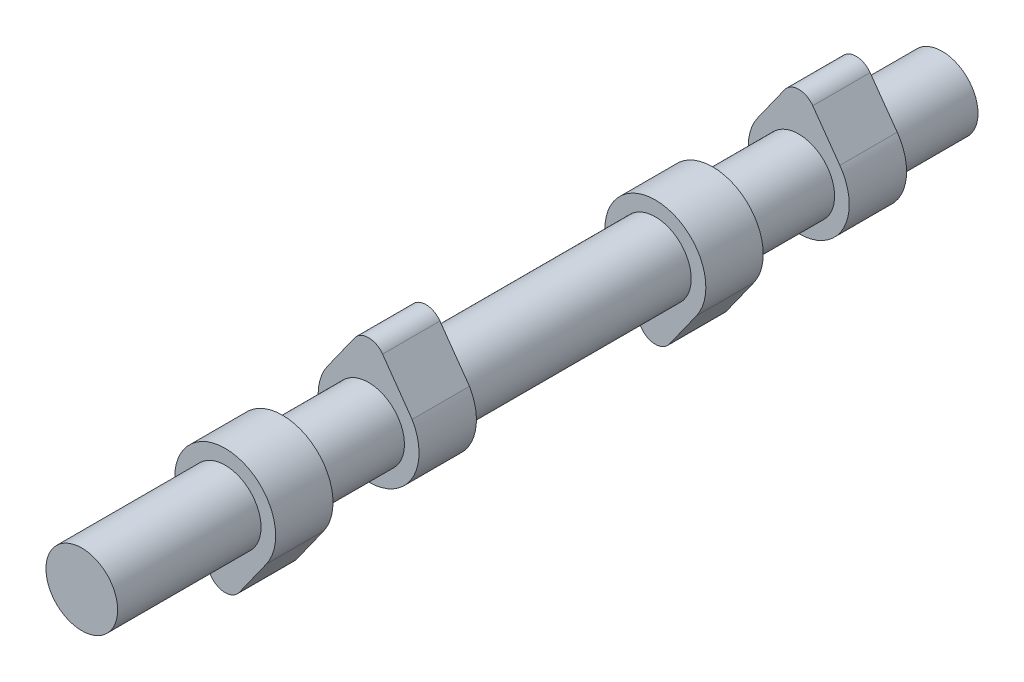
ISO-10303-21;
HEADER;
FILE_DESCRIPTION(('STEP AP214'),'2;1');
FILE_NAME('part.step','',(''),(''),'','','');
FILE_SCHEMA(('AUTOMOTIVE_DESIGN { 1 0 10303 214 1 1 1 1 }'));
ENDSEC;
DATA;
#1=APPLICATION_CONTEXT('core data for automotive mechanical design processes');
#2=APPLICATION_PROTOCOL_DEFINITION('international standard','automotive_design',2000,#1);
#3=PRODUCT_CONTEXT('',#1,'mechanical');
#4=PRODUCT('Part','Part','',(#3));
#5=PRODUCT_RELATED_PRODUCT_CATEGORY('part','',(#4));
#6=PRODUCT_DEFINITION_FORMATION('','',#4);
#7=PRODUCT_DEFINITION_CONTEXT('part definition',#1,'design');
#8=PRODUCT_DEFINITION('design','',#6,#7);
#9=PRODUCT_DEFINITION_SHAPE('','',#8);
#10=(LENGTH_UNIT() NAMED_UNIT(*) SI_UNIT(.MILLI.,.METRE.));
#11=(NAMED_UNIT(*) PLANE_ANGLE_UNIT() SI_UNIT($,.RADIAN.));
#12=(NAMED_UNIT(*) SI_UNIT($,.STERADIAN.) SOLID_ANGLE_UNIT());
#13=UNCERTAINTY_MEASURE_WITH_UNIT(LENGTH_MEASURE(1.E-05),#10,'distance_accuracy_value','');
#14=(GEOMETRIC_REPRESENTATION_CONTEXT(3) GLOBAL_UNCERTAINTY_ASSIGNED_CONTEXT((#13)) GLOBAL_UNIT_ASSIGNED_CONTEXT((#10,
#11,#12)) REPRESENTATION_CONTEXT('',''));
#15=CARTESIAN_POINT('',(0.,0.,0.));
#16=DIRECTION('',(0.,0.,1.));
#17=DIRECTION('',(1.,0.,0.));
#18=AXIS2_PLACEMENT_3D('',#15,#16,#17);
#19=CARTESIAN_POINT('',(0.,0.,125.));
#20=DIRECTION('',(0.,0.,-1.));
#21=DIRECTION('',(-1.,0.,0.));
#22=AXIS2_PLACEMENT_3D('',#19,#20,#21);
#23=CYLINDRICAL_SURFACE('',#22,6.25);
#24=CARTESIAN_POINT('',(0.,0.,40.));
#25=DIRECTION('',(0.,0.,-1.));
#26=DIRECTION('',(-1.,0.,0.));
#27=AXIS2_PLACEMENT_3D('',#24,#25,#26);
#28=CIRCLE('',#27,6.25);
#29=CARTESIAN_POINT('',(-6.25,0.,40.));
#30=VERTEX_POINT('',#29);
#31=EDGE_CURVE('E234',#30,#30,#28,.T.);
#32=ORIENTED_EDGE('',*,*,#31,.T.);
#33=EDGE_LOOP('',(#32));
#34=FACE_BOUND('',#33,.T.);
#35=CARTESIAN_POINT('',(0.,0.,25.));
#36=DIRECTION('',(0.,0.,-1.));
#37=DIRECTION('',(-1.,0.,0.));
#38=AXIS2_PLACEMENT_3D('',#35,#36,#37);
#39=CIRCLE('',#38,6.25);
#40=CARTESIAN_POINT('',(-6.25,0.,25.));
#41=VERTEX_POINT('',#40);
#42=EDGE_CURVE('E304',#41,#41,#39,.T.);
#43=ORIENTED_EDGE('',*,*,#42,.F.);
#44=EDGE_LOOP('',(#43));
#45=FACE_BOUND('',#44,.T.);
#46=ADVANCED_FACE('F37',(#34,#45),#23,.T.);
#47=CARTESIAN_POINT('',(0.,10.,25.));
#48=DIRECTION('',(0.,0.,-1.));
#49=DIRECTION('',(-1.,0.,0.));
#50=AXIS2_PLACEMENT_3D('',#47,#48,#49);
#51=CYLINDRICAL_SURFACE('',#50,3.);
#52=CARTESIAN_POINT('',(0.,10.,15.));
#53=DIRECTION('',(0.,0.,-1.));
#54=DIRECTION('',(-1.,0.,0.));
#55=AXIS2_PLACEMENT_3D('',#52,#53,#54);
#56=CIRCLE('',#55,3.);
#57=CARTESIAN_POINT('',(-2.44384942252996,11.74,15.));
#58=VERTEX_POINT('',#57);
#59=CARTESIAN_POINT('',(2.44384942252996,11.74,15.));
#60=VERTEX_POINT('',#59);
#61=EDGE_CURVE('E277',#58,#60,#56,.T.);
#62=ORIENTED_EDGE('',*,*,#61,.F.);
#63=DIRECTION('',(0.,0.,-1.));
#64=VECTOR('',#63,1.);
#65=CARTESIAN_POINT('',(-2.44384942252996,11.74,25.));
#66=LINE('',#65,#64);
#67=CARTESIAN_POINT('',(-2.44384942252996,11.74,25.));
#68=VERTEX_POINT('',#67);
#69=EDGE_CURVE('E55',#68,#58,#66,.T.);
#70=ORIENTED_EDGE('',*,*,#69,.F.);
#71=CARTESIAN_POINT('',(0.,10.,25.));
#72=DIRECTION('',(0.,0.,-1.));
#73=DIRECTION('',(-1.,0.,0.));
#74=AXIS2_PLACEMENT_3D('',#71,#72,#73);
#75=CIRCLE('',#74,3.);
#76=CARTESIAN_POINT('',(2.44384942252996,11.74,25.));
#77=VERTEX_POINT('',#76);
#78=EDGE_CURVE('E278',#68,#77,#75,.T.);
#79=ORIENTED_EDGE('',*,*,#78,.T.);
#80=DIRECTION('',(0.,0.,-1.));
#81=VECTOR('',#80,1.);
#82=CARTESIAN_POINT('',(2.44384942252996,11.74,25.));
#83=LINE('',#82,#81);
#84=EDGE_CURVE('E84',#77,#60,#83,.T.);
#85=ORIENTED_EDGE('',*,*,#84,.T.);
#86=EDGE_LOOP('',(#62,#70,#79,#85));
#87=FACE_BOUND('',#86,.T.);
#88=ADVANCED_FACE('F339',(#87),#51,.T.);
#89=CARTESIAN_POINT('',(-2.44384942252996,11.74,25.));
#90=DIRECTION('',(-0.814616474176652,0.58,0.));
#91=DIRECTION('',(-0.58,-0.814616474176652,0.));
#92=AXIS2_PLACEMENT_3D('',#89,#90,#91);
#93=PLANE('',#92);
#94=DIRECTION('',(0.58,0.814616474176652,0.));
#95=VECTOR('',#94,1.);
#96=CARTESIAN_POINT('',(-2.44384942252996,11.74,15.));
#97=LINE('',#96,#95);
#98=CARTESIAN_POINT('',(-7.16862497275454,5.104,15.));
#99=VERTEX_POINT('',#98);
#100=EDGE_CURVE('E281',#99,#58,#97,.T.);
#101=ORIENTED_EDGE('',*,*,#100,.F.);
#102=DIRECTION('',(0.,0.,-1.));
#103=VECTOR('',#102,1.);
#104=CARTESIAN_POINT('',(-7.16862497275454,5.104,25.));
#105=LINE('',#104,#103);
#106=CARTESIAN_POINT('',(-7.16862497275454,5.104,25.));
#107=VERTEX_POINT('',#106);
#108=EDGE_CURVE('E73',#107,#99,#105,.T.);
#109=ORIENTED_EDGE('',*,*,#108,.F.);
#110=DIRECTION('',(0.58,0.814616474176652,0.));
#111=VECTOR('',#110,1.);
#112=CARTESIAN_POINT('',(-2.44384942252996,11.74,25.));
#113=LINE('',#112,#111);
#114=EDGE_CURVE('E285',#107,#68,#113,.T.);
#115=ORIENTED_EDGE('',*,*,#114,.T.);
#116=ORIENTED_EDGE('',*,*,#69,.T.);
#117=EDGE_LOOP('',(#101,#109,#115,#116));
#118=FACE_BOUND('',#117,.T.);
#119=ADVANCED_FACE('F344',(#118),#93,.T.);
#120=CARTESIAN_POINT('',(0.,0.,25.));
#121=DIRECTION('',(0.,0.,-1.));
#122=DIRECTION('',(-1.,0.,0.));
#123=AXIS2_PLACEMENT_3D('',#120,#121,#122);
#124=CYLINDRICAL_SURFACE('',#123,8.8);
#125=CARTESIAN_POINT('',(0.,0.,15.));
#126=DIRECTION('',(0.,0.,-1.));
#127=DIRECTION('',(-1.,0.,0.));
#128=AXIS2_PLACEMENT_3D('',#125,#126,#127);
#129=CIRCLE('',#128,8.8);
#130=CARTESIAN_POINT('',(7.16862497275454,5.104,15.));
#131=VERTEX_POINT('',#130);
#132=EDGE_CURVE('E292',#131,#99,#129,.T.);
#133=ORIENTED_EDGE('',*,*,#132,.F.);
#134=DIRECTION('',(0.,0.,-1.));
#135=VECTOR('',#134,1.);
#136=CARTESIAN_POINT('',(7.16862497275454,5.104,25.));
#137=LINE('',#136,#135);
#138=CARTESIAN_POINT('',(7.16862497275454,5.104,25.));
#139=VERTEX_POINT('',#138);
#140=EDGE_CURVE('E299',#139,#131,#137,.T.);
#141=ORIENTED_EDGE('',*,*,#140,.F.);
#142=CARTESIAN_POINT('',(0.,0.,25.));
#143=DIRECTION('',(0.,0.,-1.));
#144=DIRECTION('',(-1.,0.,0.));
#145=AXIS2_PLACEMENT_3D('',#142,#143,#144);
#146=CIRCLE('',#145,8.8);
#147=EDGE_CURVE('E283',#139,#107,#146,.T.);
#148=ORIENTED_EDGE('',*,*,#147,.T.);
#149=ORIENTED_EDGE('',*,*,#108,.T.);
#150=EDGE_LOOP('',(#133,#141,#148,#149));
#151=FACE_BOUND('',#150,.T.);
#152=ADVANCED_FACE('F358',(#151),#124,.T.);
#153=CARTESIAN_POINT('',(2.44384942252996,11.74,25.));
#154=DIRECTION('',(0.814616474176652,0.58,0.));
#155=DIRECTION('',(-0.58,0.814616474176652,0.));
#156=AXIS2_PLACEMENT_3D('',#153,#154,#155);
#157=PLANE('',#156);
#158=DIRECTION('',(0.58,-0.814616474176652,0.));
#159=VECTOR('',#158,1.);
#160=CARTESIAN_POINT('',(2.44384942252996,11.74,15.));
#161=LINE('',#160,#159);
#162=EDGE_CURVE('E289',#60,#131,#161,.T.);
#163=ORIENTED_EDGE('',*,*,#162,.F.);
#164=ORIENTED_EDGE('',*,*,#84,.F.);
#165=DIRECTION('',(0.58,-0.814616474176652,0.));
#166=VECTOR('',#165,1.);
#167=CARTESIAN_POINT('',(2.44384942252996,11.74,25.));
#168=LINE('',#167,#166);
#169=EDGE_CURVE('E280',#77,#139,#168,.T.);
#170=ORIENTED_EDGE('',*,*,#169,.T.);
#171=ORIENTED_EDGE('',*,*,#140,.T.);
#172=EDGE_LOOP('',(#163,#164,#170,#171));
#173=FACE_BOUND('',#172,.T.);
#174=ADVANCED_FACE('F354',(#173),#157,.T.);
#175=CARTESIAN_POINT('',(0.,10.,25.));
#176=DIRECTION('',(0.,0.,-1.));
#177=DIRECTION('',(-1.,0.,0.));
#178=AXIS2_PLACEMENT_3D('',#175,#176,#177);
#179=PLANE('',#178);
#180=ORIENTED_EDGE('',*,*,#42,.T.);
#181=EDGE_LOOP('',(#180));
#182=FACE_BOUND('',#181,.T.);
#183=ORIENTED_EDGE('',*,*,#78,.F.);
#184=ORIENTED_EDGE('',*,*,#114,.F.);
#185=ORIENTED_EDGE('',*,*,#147,.F.);
#186=ORIENTED_EDGE('',*,*,#169,.F.);
#187=EDGE_LOOP('',(#183,#184,#185,#186));
#188=FACE_BOUND('',#187,.T.);
#189=ADVANCED_FACE('F350',(#182,#188),#179,.F.);
#190=CARTESIAN_POINT('',(0.,10.,15.));
#191=DIRECTION('',(0.,0.,-1.));
#192=DIRECTION('',(-1.,0.,0.));
#193=AXIS2_PLACEMENT_3D('',#190,#191,#192);
#194=PLANE('',#193);
#195=CARTESIAN_POINT('',(0.,0.,15.));
#196=DIRECTION('',(0.,0.,-1.));
#197=DIRECTION('',(-1.,0.,0.));
#198=AXIS2_PLACEMENT_3D('',#195,#196,#197);
#199=CIRCLE('',#198,6.25);
#200=CARTESIAN_POINT('',(-6.25,0.,15.));
#201=VERTEX_POINT('',#200);
#202=EDGE_CURVE('E269',#201,#201,#199,.T.);
#203=ORIENTED_EDGE('',*,*,#202,.F.);
#204=EDGE_LOOP('',(#203));
#205=FACE_BOUND('',#204,.T.);
#206=ORIENTED_EDGE('',*,*,#61,.T.);
#207=ORIENTED_EDGE('',*,*,#162,.T.);
#208=ORIENTED_EDGE('',*,*,#132,.T.);
#209=ORIENTED_EDGE('',*,*,#100,.T.);
#210=EDGE_LOOP('',(#206,#207,#208,#209));
#211=FACE_BOUND('',#210,.T.);
#212=ADVANCED_FACE('F353',(#205,#211),#194,.T.);
#213=CARTESIAN_POINT('',(0.,0.,0.));
#214=DIRECTION('',(0.,0.,1.));
#215=DIRECTION('',(1.,0.,0.));
#216=AXIS2_PLACEMENT_3D('',#213,#214,#215);
#217=PLANE('',#216);
#218=CARTESIAN_POINT('',(0.,0.,0.));
#219=DIRECTION('',(0.,0.,1.));
#220=DIRECTION('',(1.,0.,0.));
#221=AXIS2_PLACEMENT_3D('',#218,#219,#220);
#222=CIRCLE('',#221,6.25);
#223=CARTESIAN_POINT('',(6.25,0.,0.));
#224=VERTEX_POINT('',#223);
#225=EDGE_CURVE('E297',#224,#224,#222,.T.);
#226=ORIENTED_EDGE('',*,*,#225,.F.);
#227=EDGE_LOOP('',(#226));
#228=FACE_BOUND('',#227,.T.);
#229=ADVANCED_FACE('F336',(#228),#217,.F.);
#230=ORIENTED_EDGE('',*,*,#202,.T.);
#231=EDGE_LOOP('',(#230));
#232=FACE_BOUND('',#231,.T.);
#233=ORIENTED_EDGE('',*,*,#225,.T.);
#234=EDGE_LOOP('',(#233));
#235=FACE_BOUND('',#234,.T.);
#236=ADVANCED_FACE('F39',(#232,#235),#23,.T.);
#237=CARTESIAN_POINT('',(0.,-10.,50.));
#238=DIRECTION('',(0.,0.,-1.));
#239=DIRECTION('',(-1.,0.,0.));
#240=AXIS2_PLACEMENT_3D('',#237,#238,#239);
#241=CYLINDRICAL_SURFACE('',#240,3.);
#242=CARTESIAN_POINT('',(0.,-10.,40.));
#243=DIRECTION('',(0.,0.,-1.));
#244=DIRECTION('',(-1.,0.,0.));
#245=AXIS2_PLACEMENT_3D('',#242,#243,#244);
#246=CIRCLE('',#245,3.);
#247=CARTESIAN_POINT('',(2.4438494225301,-11.7399999999998,40.));
#248=VERTEX_POINT('',#247);
#249=CARTESIAN_POINT('',(-2.44384942252996,-11.74,40.));
#250=VERTEX_POINT('',#249);
#251=EDGE_CURVE('E242',#248,#250,#246,.T.);
#252=ORIENTED_EDGE('',*,*,#251,.F.);
#253=DIRECTION('',(0.,0.,-1.));
#254=VECTOR('',#253,1.);
#255=CARTESIAN_POINT('',(2.4438494225301,-11.7399999999998,50.));
#256=LINE('',#255,#254);
#257=CARTESIAN_POINT('',(2.4438494225301,-11.7399999999998,50.));
#258=VERTEX_POINT('',#257);
#259=EDGE_CURVE('E267',#258,#248,#256,.T.);
#260=ORIENTED_EDGE('',*,*,#259,.F.);
#261=CARTESIAN_POINT('',(0.,-10.,50.));
#262=DIRECTION('',(0.,0.,-1.));
#263=DIRECTION('',(-1.,0.,0.));
#264=AXIS2_PLACEMENT_3D('',#261,#262,#263);
#265=CIRCLE('',#264,3.);
#266=CARTESIAN_POINT('',(-2.44384942252996,-11.74,50.));
#267=VERTEX_POINT('',#266);
#268=EDGE_CURVE('E243',#258,#267,#265,.T.);
#269=ORIENTED_EDGE('',*,*,#268,.T.);
#270=DIRECTION('',(0.,0.,-1.));
#271=VECTOR('',#270,1.);
#272=CARTESIAN_POINT('',(-2.44384942252996,-11.74,50.));
#273=LINE('',#272,#271);
#274=EDGE_CURVE('E256',#267,#250,#273,.T.);
#275=ORIENTED_EDGE('',*,*,#274,.T.);
#276=EDGE_LOOP('',(#252,#260,#269,#275));
#277=FACE_BOUND('',#276,.T.);
#278=ADVANCED_FACE('F335',(#277),#241,.T.);
#279=CARTESIAN_POINT('',(2.4438494225301,-11.7399999999998,50.));
#280=DIRECTION('',(0.814616474176699,-0.579999999999935,0.));
#281=DIRECTION('',(0.579999999999935,0.814616474176699,0.));
#282=AXIS2_PLACEMENT_3D('',#279,#280,#281);
#283=PLANE('',#282);
#284=DIRECTION('',(-0.579999999999935,-0.814616474176699,0.));
#285=VECTOR('',#284,1.);
#286=CARTESIAN_POINT('',(2.4438494225301,-11.7399999999998,40.));
#287=LINE('',#286,#285);
#288=CARTESIAN_POINT('',(7.16862497275442,-5.10399999999905,40.));
#289=VERTEX_POINT('',#288);
#290=EDGE_CURVE('E247',#289,#248,#287,.T.);
#291=ORIENTED_EDGE('',*,*,#290,.F.);
#292=DIRECTION('',(0.,0.,-1.));
#293=VECTOR('',#292,1.);
#294=CARTESIAN_POINT('',(7.16862497275442,-5.10399999999905,50.));
#295=LINE('',#294,#293);
#296=CARTESIAN_POINT('',(7.16862497275442,-5.10399999999905,50.));
#297=VERTEX_POINT('',#296);
#298=EDGE_CURVE('E270',#297,#289,#295,.T.);
#299=ORIENTED_EDGE('',*,*,#298,.F.);
#300=DIRECTION('',(-0.579999999999935,-0.814616474176699,0.));
#301=VECTOR('',#300,1.);
#302=CARTESIAN_POINT('',(2.4438494225301,-11.7399999999998,50.));
#303=LINE('',#302,#301);
#304=EDGE_CURVE('E253',#297,#258,#303,.T.);
#305=ORIENTED_EDGE('',*,*,#304,.T.);
#306=ORIENTED_EDGE('',*,*,#259,.T.);
#307=EDGE_LOOP('',(#291,#299,#305,#306));
#308=FACE_BOUND('',#307,.T.);
#309=ADVANCED_FACE('F431',(#308),#283,.T.);
#310=CARTESIAN_POINT('',(0.,0.,50.));
#311=DIRECTION('',(0.,0.,-1.));
#312=DIRECTION('',(-1.,0.,0.));
#313=AXIS2_PLACEMENT_3D('',#310,#311,#312);
#314=CYLINDRICAL_SURFACE('',#313,8.79999999999935);
#315=CARTESIAN_POINT('',(0.,0.,40.));
#316=DIRECTION('',(0.,0.,-1.));
#317=DIRECTION('',(-1.,0.,0.));
#318=AXIS2_PLACEMENT_3D('',#315,#316,#317);
#319=CIRCLE('',#318,8.79999999999935);
#320=CARTESIAN_POINT('',(-7.16862497275441,-5.10399999999905,40.));
#321=VERTEX_POINT('',#320);
#322=EDGE_CURVE('E262',#321,#289,#319,.T.);
#323=ORIENTED_EDGE('',*,*,#322,.F.);
#324=DIRECTION('',(0.,0.,-1.));
#325=VECTOR('',#324,1.);
#326=CARTESIAN_POINT('',(-7.16862497275441,-5.10399999999905,50.));
#327=LINE('',#326,#325);
#328=CARTESIAN_POINT('',(-7.16862497275441,-5.10399999999905,50.));
#329=VERTEX_POINT('',#328);
#330=EDGE_CURVE('E272',#329,#321,#327,.T.);
#331=ORIENTED_EDGE('',*,*,#330,.F.);
#332=CARTESIAN_POINT('',(0.,0.,50.));
#333=DIRECTION('',(0.,0.,-1.));
#334=DIRECTION('',(-1.,0.,0.));
#335=AXIS2_PLACEMENT_3D('',#332,#333,#334);
#336=CIRCLE('',#335,8.79999999999935);
#337=EDGE_CURVE('E250',#329,#297,#336,.T.);
#338=ORIENTED_EDGE('',*,*,#337,.T.);
#339=ORIENTED_EDGE('',*,*,#298,.T.);
#340=EDGE_LOOP('',(#323,#331,#338,#339));
#341=FACE_BOUND('',#340,.T.);
#342=ADVANCED_FACE('F434',(#341),#314,.T.);
#343=CARTESIAN_POINT('',(-2.44384942252996,-11.74,50.));
#344=DIRECTION('',(-0.814616474176699,-0.579999999999934,0.));
#345=DIRECTION('',(0.579999999999934,-0.814616474176699,0.));
#346=AXIS2_PLACEMENT_3D('',#343,#344,#345);
#347=PLANE('',#346);
#348=DIRECTION('',(-0.579999999999934,0.814616474176699,0.));
#349=VECTOR('',#348,1.);
#350=CARTESIAN_POINT('',(-2.44384942252996,-11.74,40.));
#351=LINE('',#350,#349);
#352=EDGE_CURVE('E259',#250,#321,#351,.T.);
#353=ORIENTED_EDGE('',*,*,#352,.F.);
#354=ORIENTED_EDGE('',*,*,#274,.F.);
#355=DIRECTION('',(-0.579999999999934,0.814616474176699,0.));
#356=VECTOR('',#355,1.);
#357=CARTESIAN_POINT('',(-2.44384942252996,-11.74,50.));
#358=LINE('',#357,#356);
#359=EDGE_CURVE('E246',#267,#329,#358,.T.);
#360=ORIENTED_EDGE('',*,*,#359,.T.);
#361=ORIENTED_EDGE('',*,*,#330,.T.);
#362=EDGE_LOOP('',(#353,#354,#360,#361));
#363=FACE_BOUND('',#362,.T.);
#364=ADVANCED_FACE('F427',(#363),#347,.T.);
#365=CARTESIAN_POINT('',(0.,-10.,50.));
#366=DIRECTION('',(0.,0.,-1.));
#367=DIRECTION('',(-1.,0.,0.));
#368=AXIS2_PLACEMENT_3D('',#365,#366,#367);
#369=PLANE('',#368);
#370=CARTESIAN_POINT('',(0.,0.,50.));
#371=DIRECTION('',(0.,0.,-1.));
#372=DIRECTION('',(-1.,0.,0.));
#373=AXIS2_PLACEMENT_3D('',#370,#371,#372);
#374=CIRCLE('',#373,6.25);
#375=CARTESIAN_POINT('',(-6.25,0.,50.));
#376=VERTEX_POINT('',#375);
#377=EDGE_CURVE('E306',#376,#376,#374,.T.);
#378=ORIENTED_EDGE('',*,*,#377,.T.);
#379=EDGE_LOOP('',(#378));
#380=FACE_BOUND('',#379,.T.);
#381=ORIENTED_EDGE('',*,*,#268,.F.);
#382=ORIENTED_EDGE('',*,*,#304,.F.);
#383=ORIENTED_EDGE('',*,*,#337,.F.);
#384=ORIENTED_EDGE('',*,*,#359,.F.);
#385=EDGE_LOOP('',(#381,#382,#383,#384));
#386=FACE_BOUND('',#385,.T.);
#387=ADVANCED_FACE('F424',(#380,#386),#369,.F.);
#388=CARTESIAN_POINT('',(0.,-10.,40.));
#389=DIRECTION('',(0.,0.,-1.));
#390=DIRECTION('',(-1.,0.,0.));
#391=AXIS2_PLACEMENT_3D('',#388,#389,#390);
#392=PLANE('',#391);
#393=ORIENTED_EDGE('',*,*,#31,.F.);
#394=EDGE_LOOP('',(#393));
#395=FACE_BOUND('',#394,.T.);
#396=ORIENTED_EDGE('',*,*,#251,.T.);
#397=ORIENTED_EDGE('',*,*,#352,.T.);
#398=ORIENTED_EDGE('',*,*,#322,.T.);
#399=ORIENTED_EDGE('',*,*,#290,.T.);
#400=EDGE_LOOP('',(#396,#397,#398,#399));
#401=FACE_BOUND('',#400,.T.);
#402=ADVANCED_FACE('F332',(#395,#401),#392,.T.);
#403=CARTESIAN_POINT('',(0.,0.,90.));
#404=DIRECTION('',(0.,0.,-1.));
#405=DIRECTION('',(-1.,0.,0.));
#406=AXIS2_PLACEMENT_3D('',#403,#404,#405);
#407=CIRCLE('',#406,6.25);
#408=CARTESIAN_POINT('',(-6.25,0.,90.));
#409=VERTEX_POINT('',#408);
#410=EDGE_CURVE('E202',#409,#409,#407,.T.);
#411=ORIENTED_EDGE('',*,*,#410,.T.);
#412=EDGE_LOOP('',(#411));
#413=FACE_BOUND('',#412,.T.);
#414=ORIENTED_EDGE('',*,*,#377,.F.);
#415=EDGE_LOOP('',(#414));
#416=FACE_BOUND('',#415,.T.);
#417=ADVANCED_FACE('F320',(#413,#416),#23,.T.);
#418=CARTESIAN_POINT('',(-7.16862497275454,5.104,100.));
#419=DIRECTION('',(0.814616474176652,-0.58,0.));
#420=DIRECTION('',(0.58,0.814616474176652,0.));
#421=AXIS2_PLACEMENT_3D('',#418,#419,#420);
#422=PLANE('',#421);
#423=DIRECTION('',(-0.58,-0.814616474176652,0.));
#424=VECTOR('',#423,1.);
#425=CARTESIAN_POINT('',(-7.16862497275454,5.104,90.));
#426=LINE('',#425,#424);
#427=CARTESIAN_POINT('',(-2.44384942252996,11.74,90.));
#428=VERTEX_POINT('',#427);
#429=CARTESIAN_POINT('',(-7.16862497275454,5.104,90.));
#430=VERTEX_POINT('',#429);
#431=EDGE_CURVE('E221',#428,#430,#426,.T.);
#432=ORIENTED_EDGE('',*,*,#431,.T.);
#433=DIRECTION('',(0.,0.,-1.));
#434=VECTOR('',#433,1.);
#435=CARTESIAN_POINT('',(-7.16862497275454,5.104,100.));
#436=LINE('',#435,#434);
#437=CARTESIAN_POINT('',(-7.16862497275454,5.104,100.));
#438=VERTEX_POINT('',#437);
#439=EDGE_CURVE('E232',#438,#430,#436,.T.);
#440=ORIENTED_EDGE('',*,*,#439,.F.);
#441=DIRECTION('',(-0.58,-0.814616474176652,0.));
#442=VECTOR('',#441,1.);
#443=CARTESIAN_POINT('',(-7.16862497275454,5.104,100.));
#444=LINE('',#443,#442);
#445=CARTESIAN_POINT('',(-2.44384942252996,11.74,100.));
#446=VERTEX_POINT('',#445);
#447=EDGE_CURVE('E206',#446,#438,#444,.T.);
#448=ORIENTED_EDGE('',*,*,#447,.F.);
#449=DIRECTION('',(0.,0.,-1.));
#450=VECTOR('',#449,1.);
#451=CARTESIAN_POINT('',(-2.44384942252996,11.74,100.));
#452=LINE('',#451,#450);
#453=EDGE_CURVE('E218',#446,#428,#452,.T.);
#454=ORIENTED_EDGE('',*,*,#453,.T.);
#455=EDGE_LOOP('',(#432,#440,#448,#454));
#456=FACE_BOUND('',#455,.T.);
#457=ADVANCED_FACE('F331',(#456),#422,.F.);
#458=CARTESIAN_POINT('',(0.,0.,100.));
#459=DIRECTION('',(0.,0.,-1.));
#460=DIRECTION('',(-1.,0.,0.));
#461=AXIS2_PLACEMENT_3D('',#458,#459,#460);
#462=CYLINDRICAL_SURFACE('',#461,8.8);
#463=CARTESIAN_POINT('',(0.,0.,90.));
#464=DIRECTION('',(0.,0.,-1.));
#465=DIRECTION('',(-1.,0.,0.));
#466=AXIS2_PLACEMENT_3D('',#463,#464,#465);
#467=CIRCLE('',#466,8.8);
#468=CARTESIAN_POINT('',(7.58748192688418,4.45759105450533,90.));
#469=VERTEX_POINT('',#468);
#470=EDGE_CURVE('E209',#469,#430,#467,.T.);
#471=ORIENTED_EDGE('',*,*,#470,.F.);
#472=DIRECTION('',(0.,0.,-1.));
#473=VECTOR('',#472,1.);
#474=CARTESIAN_POINT('',(7.58748192688418,4.45759105450533,100.));
#475=LINE('',#474,#473);
#476=CARTESIAN_POINT('',(7.58748192688418,4.45759105450533,100.));
#477=VERTEX_POINT('',#476);
#478=EDGE_CURVE('E235',#477,#469,#475,.T.);
#479=ORIENTED_EDGE('',*,*,#478,.F.);
#480=CARTESIAN_POINT('',(0.,0.,100.));
#481=DIRECTION('',(0.,0.,-1.));
#482=DIRECTION('',(-1.,0.,0.));
#483=AXIS2_PLACEMENT_3D('',#480,#481,#482);
#484=CIRCLE('',#483,8.8);
#485=EDGE_CURVE('E215',#477,#438,#484,.T.);
#486=ORIENTED_EDGE('',*,*,#485,.T.);
#487=ORIENTED_EDGE('',*,*,#439,.T.);
#488=EDGE_LOOP('',(#471,#479,#486,#487));
#489=FACE_BOUND('',#488,.T.);
#490=ADVANCED_FACE('F410',(#489),#462,.T.);
#491=CARTESIAN_POINT('',(7.1626626770346,5.05905461215725,100.));
#492=DIRECTION('',(0.816803566389261,0.576915881159277,0.));
#493=DIRECTION('',(-0.576915881159277,0.816803566389261,0.));
#494=AXIS2_PLACEMENT_3D('',#491,#492,#493);
#495=PLANE('',#494);
#496=DIRECTION('',(0.576915881159277,-0.816803566389261,0.));
#497=VECTOR('',#496,1.);
#498=CARTESIAN_POINT('',(7.1626626770346,5.05905461215725,90.));
#499=LINE('',#498,#497);
#500=CARTESIAN_POINT('',(2.44384942252996,11.74,90.));
#501=VERTEX_POINT('',#500);
#502=EDGE_CURVE('E227',#501,#469,#499,.T.);
#503=ORIENTED_EDGE('',*,*,#502,.F.);
#504=DIRECTION('',(0.,0.,-1.));
#505=VECTOR('',#504,1.);
#506=CARTESIAN_POINT('',(2.44384942252996,11.74,100.));
#507=LINE('',#506,#505);
#508=CARTESIAN_POINT('',(2.44384942252996,11.74,100.));
#509=VERTEX_POINT('',#508);
#510=EDGE_CURVE('E237',#509,#501,#507,.T.);
#511=ORIENTED_EDGE('',*,*,#510,.F.);
#512=DIRECTION('',(0.576915881159277,-0.816803566389261,0.));
#513=VECTOR('',#512,1.);
#514=CARTESIAN_POINT('',(7.1626626770346,5.05905461215725,100.));
#515=LINE('',#514,#513);
#516=EDGE_CURVE('E212',#509,#477,#515,.T.);
#517=ORIENTED_EDGE('',*,*,#516,.T.);
#518=ORIENTED_EDGE('',*,*,#478,.T.);
#519=EDGE_LOOP('',(#503,#511,#517,#518));
#520=FACE_BOUND('',#519,.T.);
#521=ADVANCED_FACE('F413',(#520),#495,.T.);
#522=CARTESIAN_POINT('',(0.,10.,100.));
#523=DIRECTION('',(0.,0.,-1.));
#524=DIRECTION('',(-1.,0.,0.));
#525=AXIS2_PLACEMENT_3D('',#522,#523,#524);
#526=CYLINDRICAL_SURFACE('',#525,3.);
#527=CARTESIAN_POINT('',(0.,10.,90.));
#528=DIRECTION('',(0.,0.,-1.));
#529=DIRECTION('',(-1.,0.,0.));
#530=AXIS2_PLACEMENT_3D('',#527,#528,#529);
#531=CIRCLE('',#530,3.);
#532=EDGE_CURVE('E224',#428,#501,#531,.T.);
#533=ORIENTED_EDGE('',*,*,#532,.F.);
#534=ORIENTED_EDGE('',*,*,#453,.F.);
#535=CARTESIAN_POINT('',(0.,10.,100.));
#536=DIRECTION('',(0.,0.,-1.));
#537=DIRECTION('',(-1.,0.,0.));
#538=AXIS2_PLACEMENT_3D('',#535,#536,#537);
#539=CIRCLE('',#538,3.);
#540=EDGE_CURVE('E208',#446,#509,#539,.T.);
#541=ORIENTED_EDGE('',*,*,#540,.T.);
#542=ORIENTED_EDGE('',*,*,#510,.T.);
#543=EDGE_LOOP('',(#533,#534,#541,#542));
#544=FACE_BOUND('',#543,.T.);
#545=ADVANCED_FACE('F408',(#544),#526,.T.);
#546=CARTESIAN_POINT('',(0.,0.,100.));
#547=DIRECTION('',(0.,0.,-1.));
#548=DIRECTION('',(-1.,0.,0.));
#549=AXIS2_PLACEMENT_3D('',#546,#547,#548);
#550=PLANE('',#549);
#551=CARTESIAN_POINT('',(0.,0.,100.));
#552=DIRECTION('',(0.,0.,-1.));
#553=DIRECTION('',(-1.,0.,0.));
#554=AXIS2_PLACEMENT_3D('',#551,#552,#553);
#555=CIRCLE('',#554,6.25);
#556=CARTESIAN_POINT('',(-6.25,0.,100.));
#557=VERTEX_POINT('',#556);
#558=EDGE_CURVE('E41',#557,#557,#555,.T.);
#559=ORIENTED_EDGE('',*,*,#558,.T.);
#560=EDGE_LOOP('',(#559));
#561=FACE_BOUND('',#560,.T.);
#562=ORIENTED_EDGE('',*,*,#447,.T.);
#563=ORIENTED_EDGE('',*,*,#485,.F.);
#564=ORIENTED_EDGE('',*,*,#516,.F.);
#565=ORIENTED_EDGE('',*,*,#540,.F.);
#566=EDGE_LOOP('',(#562,#563,#564,#565));
#567=FACE_BOUND('',#566,.T.);
#568=ADVANCED_FACE('F313',(#561,#567),#550,.F.);
#569=CARTESIAN_POINT('',(0.,0.,90.));
#570=DIRECTION('',(0.,0.,-1.));
#571=DIRECTION('',(-1.,0.,0.));
#572=AXIS2_PLACEMENT_3D('',#569,#570,#571);
#573=PLANE('',#572);
#574=ORIENTED_EDGE('',*,*,#410,.F.);
#575=EDGE_LOOP('',(#574));
#576=FACE_BOUND('',#575,.T.);
#577=ORIENTED_EDGE('',*,*,#431,.F.);
#578=ORIENTED_EDGE('',*,*,#532,.T.);
#579=ORIENTED_EDGE('',*,*,#502,.T.);
#580=ORIENTED_EDGE('',*,*,#470,.T.);
#581=EDGE_LOOP('',(#577,#578,#579,#580));
#582=FACE_BOUND('',#581,.T.);
#583=ADVANCED_FACE('F318',(#576,#582),#573,.T.);
#584=CARTESIAN_POINT('',(0.,0.,115.));
#585=DIRECTION('',(0.,0.,-1.));
#586=DIRECTION('',(-1.,0.,0.));
#587=AXIS2_PLACEMENT_3D('',#584,#585,#586);
#588=CIRCLE('',#587,6.25);
#589=CARTESIAN_POINT('',(-6.25,0.,115.));
#590=VERTEX_POINT('',#589);
#591=EDGE_CURVE('E192',#590,#590,#588,.T.);
#592=ORIENTED_EDGE('',*,*,#591,.T.);
#593=EDGE_LOOP('',(#592));
#594=FACE_BOUND('',#593,.T.);
#595=ORIENTED_EDGE('',*,*,#558,.F.);
#596=EDGE_LOOP('',(#595));
#597=FACE_BOUND('',#596,.T.);
#598=ADVANCED_FACE('F316',(#594,#597),#23,.T.);
#599=CARTESIAN_POINT('',(0.,-10.,125.));
#600=DIRECTION('',(0.,0.,-1.));
#601=DIRECTION('',(-1.,0.,0.));
#602=AXIS2_PLACEMENT_3D('',#599,#600,#601);
#603=CYLINDRICAL_SURFACE('',#602,3.);
#604=CARTESIAN_POINT('',(0.,-10.,115.));
#605=DIRECTION('',(0.,0.,-1.));
#606=DIRECTION('',(-1.,0.,0.));
#607=AXIS2_PLACEMENT_3D('',#604,#605,#606);
#608=CIRCLE('',#607,3.);
#609=CARTESIAN_POINT('',(2.4438494225301,-11.7399999999998,115.));
#610=VERTEX_POINT('',#609);
#611=CARTESIAN_POINT('',(-2.44384942252996,-11.74,115.));
#612=VERTEX_POINT('',#611);
#613=EDGE_CURVE('E196',#610,#612,#608,.T.);
#614=ORIENTED_EDGE('',*,*,#613,.F.);
#615=DIRECTION('',(0.,0.,-1.));
#616=VECTOR('',#615,1.);
#617=CARTESIAN_POINT('',(2.4438494225301,-11.7399999999998,125.));
#618=LINE('',#617,#616);
#619=CARTESIAN_POINT('',(2.4438494225301,-11.7399999999998,125.));
#620=VERTEX_POINT('',#619);
#621=EDGE_CURVE('E185',#620,#610,#618,.T.);
#622=ORIENTED_EDGE('',*,*,#621,.F.);
#623=CARTESIAN_POINT('',(0.,-10.,125.));
#624=DIRECTION('',(0.,0.,-1.));
#625=DIRECTION('',(-1.,0.,0.));
#626=AXIS2_PLACEMENT_3D('',#623,#624,#625);
#627=CIRCLE('',#626,3.);
#628=CARTESIAN_POINT('',(-2.44384942252996,-11.74,125.));
#629=VERTEX_POINT('',#628);
#630=EDGE_CURVE('E179',#620,#629,#627,.T.);
#631=ORIENTED_EDGE('',*,*,#630,.T.);
#632=DIRECTION('',(0.,0.,-1.));
#633=VECTOR('',#632,1.);
#634=CARTESIAN_POINT('',(-2.44384942252996,-11.74,125.));
#635=LINE('',#634,#633);
#636=EDGE_CURVE('E161',#629,#612,#635,.T.);
#637=ORIENTED_EDGE('',*,*,#636,.T.);
#638=EDGE_LOOP('',(#614,#622,#631,#637));
#639=FACE_BOUND('',#638,.T.);
#640=ADVANCED_FACE('F184',(#639),#603,.T.);
#641=CARTESIAN_POINT('',(7.16862497275442,-5.10399999999905,125.));
#642=DIRECTION('',(0.814616474176699,-0.579999999999935,0.));
#643=DIRECTION('',(0.579999999999935,0.814616474176699,0.));
#644=AXIS2_PLACEMENT_3D('',#641,#642,#643);
#645=PLANE('',#644);
#646=DIRECTION('',(-0.579999999999935,-0.814616474176699,0.));
#647=VECTOR('',#646,1.);
#648=CARTESIAN_POINT('',(7.16862497275442,-5.10399999999905,115.));
#649=LINE('',#648,#647);
#650=CARTESIAN_POINT('',(7.16862497275442,-5.10399999999905,115.));
#651=VERTEX_POINT('',#650);
#652=EDGE_CURVE('E186',#651,#610,#649,.T.);
#653=ORIENTED_EDGE('',*,*,#652,.F.);
#654=DIRECTION('',(0.,0.,-1.));
#655=VECTOR('',#654,1.);
#656=CARTESIAN_POINT('',(7.16862497275442,-5.10399999999905,125.));
#657=LINE('',#656,#655);
#658=CARTESIAN_POINT('',(7.16862497275442,-5.10399999999905,125.));
#659=VERTEX_POINT('',#658);
#660=EDGE_CURVE('E203',#659,#651,#657,.T.);
#661=ORIENTED_EDGE('',*,*,#660,.F.);
#662=DIRECTION('',(-0.579999999999935,-0.814616474176699,0.));
#663=VECTOR('',#662,1.);
#664=CARTESIAN_POINT('',(7.16862497275442,-5.10399999999905,125.));
#665=LINE('',#664,#663);
#666=EDGE_CURVE('E172',#659,#620,#665,.T.);
#667=ORIENTED_EDGE('',*,*,#666,.T.);
#668=ORIENTED_EDGE('',*,*,#621,.T.);
#669=EDGE_LOOP('',(#653,#661,#667,#668));
#670=FACE_BOUND('',#669,.T.);
#671=ADVANCED_FACE('F325',(#670),#645,.T.);
#672=CARTESIAN_POINT('',(0.,0.,125.));
#673=DIRECTION('',(0.,0.,-1.));
#674=DIRECTION('',(-1.,0.,0.));
#675=AXIS2_PLACEMENT_3D('',#672,#673,#674);
#676=CYLINDRICAL_SURFACE('',#675,8.79999999999935);
#677=CARTESIAN_POINT('',(0.,0.,115.));
#678=DIRECTION('',(0.,0.,-1.));
#679=DIRECTION('',(-1.,0.,0.));
#680=AXIS2_PLACEMENT_3D('',#677,#678,#679);
#681=CIRCLE('',#680,8.79999999999935);
#682=CARTESIAN_POINT('',(-7.16862497275441,-5.10399999999905,115.));
#683=VERTEX_POINT('',#682);
#684=EDGE_CURVE('E189',#683,#651,#681,.T.);
#685=ORIENTED_EDGE('',*,*,#684,.F.);
#686=DIRECTION('',(0.,0.,-1.));
#687=VECTOR('',#686,1.);
#688=CARTESIAN_POINT('',(-7.16862497275441,-5.10399999999905,125.));
#689=LINE('',#688,#687);
#690=CARTESIAN_POINT('',(-7.16862497275441,-5.10399999999905,125.));
#691=VERTEX_POINT('',#690);
#692=EDGE_CURVE('E171',#691,#683,#689,.T.);
#693=ORIENTED_EDGE('',*,*,#692,.F.);
#694=CARTESIAN_POINT('',(0.,0.,125.));
#695=DIRECTION('',(0.,0.,-1.));
#696=DIRECTION('',(-1.,0.,0.));
#697=AXIS2_PLACEMENT_3D('',#694,#695,#696);
#698=CIRCLE('',#697,8.79999999999935);
#699=EDGE_CURVE('E182',#691,#659,#698,.T.);
#700=ORIENTED_EDGE('',*,*,#699,.T.);
#701=ORIENTED_EDGE('',*,*,#660,.T.);
#702=EDGE_LOOP('',(#685,#693,#700,#701));
#703=FACE_BOUND('',#702,.T.);
#704=ADVANCED_FACE('F395',(#703),#676,.T.);
#705=CARTESIAN_POINT('',(-2.44384942252996,-11.74,125.));
#706=DIRECTION('',(-0.814616474176699,-0.579999999999934,0.));
#707=DIRECTION('',(0.579999999999934,-0.814616474176699,0.));
#708=AXIS2_PLACEMENT_3D('',#705,#706,#707);
#709=PLANE('',#708);
#710=DIRECTION('',(-0.579999999999935,0.814616474176699,0.));
#711=VECTOR('',#710,1.);
#712=CARTESIAN_POINT('',(-2.44384942252996,-11.74,115.));
#713=LINE('',#712,#711);
#714=EDGE_CURVE('E166',#612,#683,#713,.T.);
#715=ORIENTED_EDGE('',*,*,#714,.F.);
#716=ORIENTED_EDGE('',*,*,#636,.F.);
#717=DIRECTION('',(-0.579999999999935,0.814616474176699,0.));
#718=VECTOR('',#717,1.);
#719=CARTESIAN_POINT('',(-2.44384942252996,-11.74,125.));
#720=LINE('',#719,#718);
#721=EDGE_CURVE('E164',#629,#691,#720,.T.);
#722=ORIENTED_EDGE('',*,*,#721,.T.);
#723=ORIENTED_EDGE('',*,*,#692,.T.);
#724=EDGE_LOOP('',(#715,#716,#722,#723));
#725=FACE_BOUND('',#724,.T.);
#726=ADVANCED_FACE('F163',(#725),#709,.T.);
#727=CARTESIAN_POINT('',(0.,-10.,115.));
#728=DIRECTION('',(0.,0.,-1.));
#729=DIRECTION('',(-1.,0.,0.));
#730=AXIS2_PLACEMENT_3D('',#727,#728,#729);
#731=PLANE('',#730);
#732=ORIENTED_EDGE('',*,*,#591,.F.);
#733=EDGE_LOOP('',(#732));
#734=FACE_BOUND('',#733,.T.);
#735=ORIENTED_EDGE('',*,*,#613,.T.);
#736=ORIENTED_EDGE('',*,*,#714,.T.);
#737=ORIENTED_EDGE('',*,*,#684,.T.);
#738=ORIENTED_EDGE('',*,*,#652,.T.);
#739=EDGE_LOOP('',(#735,#736,#737,#738));
#740=FACE_BOUND('',#739,.T.);
#741=ADVANCED_FACE('F378',(#734,#740),#731,.T.);
#742=CARTESIAN_POINT('',(0.,0.,125.));
#743=DIRECTION('',(0.,0.,1.));
#744=DIRECTION('',(1.,0.,0.));
#745=AXIS2_PLACEMENT_3D('',#742,#743,#744);
#746=PLANE('',#745);
#747=CARTESIAN_POINT('',(0.,0.,125.));
#748=DIRECTION('',(0.,0.,1.));
#749=DIRECTION('',(1.,0.,0.));
#750=AXIS2_PLACEMENT_3D('',#747,#748,#749);
#751=CIRCLE('',#750,6.25);
#752=CARTESIAN_POINT('',(6.25,0.,125.));
#753=VERTEX_POINT('',#752);
#754=EDGE_CURVE('E11',#753,#753,#751,.T.);
#755=ORIENTED_EDGE('',*,*,#754,.F.);
#756=EDGE_LOOP('',(#755));
#757=FACE_BOUND('',#756,.T.);
#758=ORIENTED_EDGE('',*,*,#630,.F.);
#759=ORIENTED_EDGE('',*,*,#666,.F.);
#760=ORIENTED_EDGE('',*,*,#699,.F.);
#761=ORIENTED_EDGE('',*,*,#721,.F.);
#762=EDGE_LOOP('',(#758,#759,#760,#761));
#763=FACE_BOUND('',#762,.T.);
#764=ADVANCED_FACE('F177',(#757,#763),#746,.T.);
#765=CARTESIAN_POINT('',(0.,0.,150.));
#766=DIRECTION('',(0.,0.,-1.));
#767=DIRECTION('',(-1.,0.,0.));
#768=AXIS2_PLACEMENT_3D('',#765,#766,#767);
#769=CYLINDRICAL_SURFACE('',#768,6.25);
#770=CARTESIAN_POINT('',(0.,0.,150.));
#771=DIRECTION('',(0.,0.,1.));
#772=DIRECTION('',(1.,0.,0.));
#773=AXIS2_PLACEMENT_3D('',#770,#771,#772);
#774=CIRCLE('',#773,6.25);
#775=CARTESIAN_POINT('',(6.25,0.,150.));
#776=VERTEX_POINT('',#775);
#777=EDGE_CURVE('E565',#776,#776,#774,.T.);
#778=ORIENTED_EDGE('',*,*,#777,.F.);
#779=EDGE_LOOP('',(#778));
#780=FACE_BOUND('',#779,.T.);
#781=ORIENTED_EDGE('',*,*,#754,.T.);
#782=EDGE_LOOP('',(#781));
#783=FACE_BOUND('',#782,.T.);
#784=ADVANCED_FACE('F377',(#780,#783),#769,.T.);
#785=CARTESIAN_POINT('',(0.,0.,150.));
#786=DIRECTION('',(0.,0.,1.));
#787=DIRECTION('',(1.,0.,0.));
#788=AXIS2_PLACEMENT_3D('',#785,#786,#787);
#789=PLANE('',#788);
#790=ORIENTED_EDGE('',*,*,#777,.T.);
#791=EDGE_LOOP('',(#790));
#792=FACE_BOUND('',#791,.T.);
#793=ADVANCED_FACE('F385',(#792),#789,.T.);
#794=CLOSED_SHELL('',(#46,#88,#119,#152,#174,#189,#212,#229,#236,#278,#309,#342,#364,#387,#402,
#417,#457,#490,#521,#545,#568,#583,#598,#640,#671,#704,#726,#741,#764,#784,#793));
#795=MANIFOLD_SOLID_BREP('B2',#794);
#796=ADVANCED_BREP_SHAPE_REPRESENTATION('',(#18,#795),#14);
#797=SHAPE_DEFINITION_REPRESENTATION(#9,#796);
ENDSEC;
END-ISO-10303-21;
